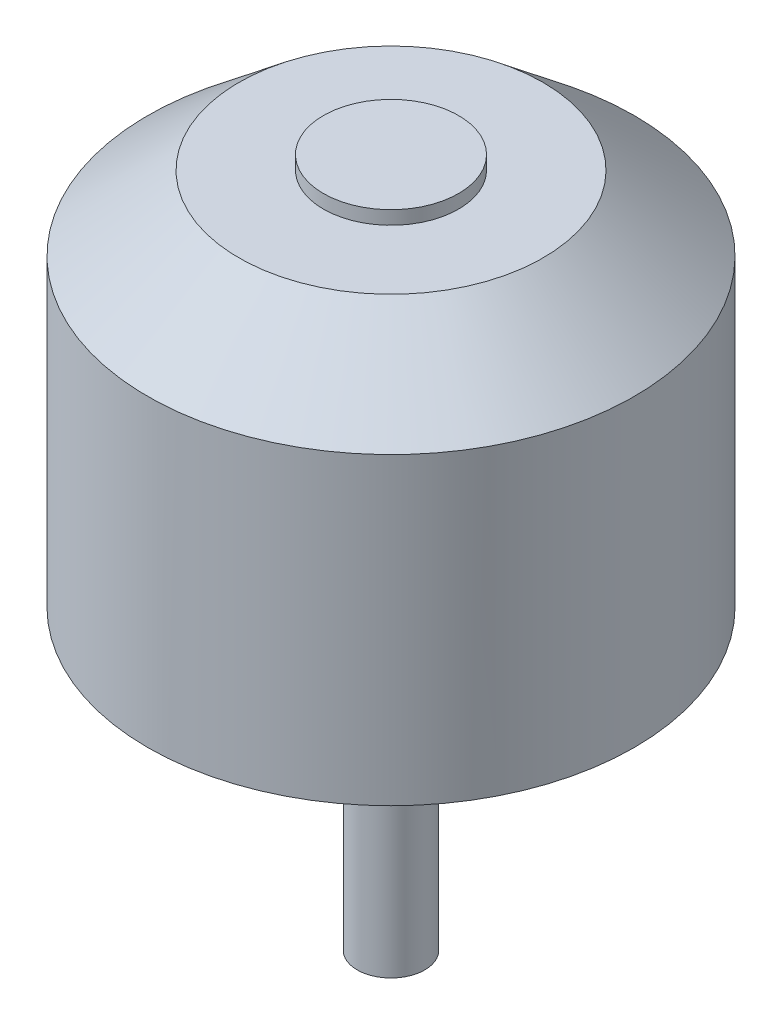
ISO-10303-21;
HEADER;
FILE_DESCRIPTION(('STEP AP214'),'2;1');
FILE_NAME('part.step','',(''),(''),'','','');
FILE_SCHEMA(('AUTOMOTIVE_DESIGN { 1 0 10303 214 1 1 1 1 }'));
ENDSEC;
DATA;
#1=APPLICATION_CONTEXT('core data for automotive mechanical design processes');
#2=APPLICATION_PROTOCOL_DEFINITION('international standard','automotive_design',2000,#1);
#3=PRODUCT_CONTEXT('',#1,'mechanical');
#4=PRODUCT('Part','Part','',(#3));
#5=PRODUCT_RELATED_PRODUCT_CATEGORY('part','',(#4));
#6=PRODUCT_DEFINITION_FORMATION('','',#4);
#7=PRODUCT_DEFINITION_CONTEXT('part definition',#1,'design');
#8=PRODUCT_DEFINITION('design','',#6,#7);
#9=PRODUCT_DEFINITION_SHAPE('','',#8);
#10=(LENGTH_UNIT() NAMED_UNIT(*) SI_UNIT(.MILLI.,.METRE.));
#11=(NAMED_UNIT(*) PLANE_ANGLE_UNIT() SI_UNIT($,.RADIAN.));
#12=(NAMED_UNIT(*) SI_UNIT($,.STERADIAN.) SOLID_ANGLE_UNIT());
#13=UNCERTAINTY_MEASURE_WITH_UNIT(LENGTH_MEASURE(1.E-05),#10,'distance_accuracy_value','');
#14=(GEOMETRIC_REPRESENTATION_CONTEXT(3) GLOBAL_UNCERTAINTY_ASSIGNED_CONTEXT((#13)) GLOBAL_UNIT_ASSIGNED_CONTEXT((#10,
#11,#12)) REPRESENTATION_CONTEXT('',''));
#15=CARTESIAN_POINT('',(0.,0.,0.));
#16=DIRECTION('',(0.,0.,1.));
#17=DIRECTION('',(1.,0.,0.));
#18=AXIS2_PLACEMENT_3D('',#15,#16,#17);
#19=CARTESIAN_POINT('',(0.,29.,0.));
#20=DIRECTION('',(0.,-1.,0.));
#21=DIRECTION('',(0.,0.,-1.));
#22=AXIS2_PLACEMENT_3D('',#19,#20,#21);
#23=CYLINDRICAL_SURFACE('',#22,18.);
#24=CARTESIAN_POINT('',(0.,0.,0.));
#25=DIRECTION('',(0.,1.,0.));
#26=DIRECTION('',(0.,0.,1.));
#27=AXIS2_PLACEMENT_3D('',#24,#25,#26);
#28=CIRCLE('',#27,18.);
#29=CARTESIAN_POINT('',(0.,0.,18.));
#30=VERTEX_POINT('',#29);
#31=EDGE_CURVE('E43',#30,#30,#28,.T.);
#32=ORIENTED_EDGE('',*,*,#31,.T.);
#33=EDGE_LOOP('',(#32));
#34=FACE_BOUND('',#33,.T.);
#35=CARTESIAN_POINT('',(0.,22.5,0.));
#36=DIRECTION('',(0.,-1.,0.));
#37=DIRECTION('',(0.,0.,-1.));
#38=AXIS2_PLACEMENT_3D('',#35,#36,#37);
#39=CIRCLE('',#38,18.);
#40=CARTESIAN_POINT('',(0.,22.5,-18.));
#41=VERTEX_POINT('',#40);
#42=EDGE_CURVE('E67',#41,#41,#39,.T.);
#43=ORIENTED_EDGE('',*,*,#42,.T.);
#44=EDGE_LOOP('',(#43));
#45=FACE_BOUND('',#44,.T.);
#46=ADVANCED_FACE('F36',(#34,#45),#23,.T.);
#47=CARTESIAN_POINT('',(0.,0.,0.));
#48=DIRECTION('',(0.,1.,0.));
#49=DIRECTION('',(0.,0.,1.));
#50=AXIS2_PLACEMENT_3D('',#47,#48,#49);
#51=PLANE('',#50);
#52=CARTESIAN_POINT('',(0.,0.,0.));
#53=DIRECTION('',(0.,1.,0.));
#54=DIRECTION('',(0.,0.,1.));
#55=AXIS2_PLACEMENT_3D('',#52,#53,#54);
#56=CIRCLE('',#55,2.5);
#57=CARTESIAN_POINT('',(0.,0.,2.5));
#58=VERTEX_POINT('',#57);
#59=EDGE_CURVE('E10',#58,#58,#56,.F.);
#60=ORIENTED_EDGE('',*,*,#59,.F.);
#61=EDGE_LOOP('',(#60));
#62=FACE_BOUND('',#61,.T.);
#63=ORIENTED_EDGE('',*,*,#31,.F.);
#64=EDGE_LOOP('',(#63));
#65=FACE_BOUND('',#64,.T.);
#66=ADVANCED_FACE('F91',(#62,#65),#51,.F.);
#67=CARTESIAN_POINT('',(0.,-22.,0.));
#68=DIRECTION('',(0.,1.,0.));
#69=DIRECTION('',(0.,0.,1.));
#70=AXIS2_PLACEMENT_3D('',#67,#68,#69);
#71=CYLINDRICAL_SURFACE('',#70,2.5);
#72=CARTESIAN_POINT('',(0.,-22.,0.));
#73=DIRECTION('',(0.,-1.,0.));
#74=DIRECTION('',(0.,0.,-1.));
#75=AXIS2_PLACEMENT_3D('',#72,#73,#74);
#76=CIRCLE('',#75,2.5);
#77=CARTESIAN_POINT('',(0.,-22.,-2.5));
#78=VERTEX_POINT('',#77);
#79=EDGE_CURVE('E48',#78,#78,#76,.T.);
#80=ORIENTED_EDGE('',*,*,#79,.F.);
#81=EDGE_LOOP('',(#80));
#82=FACE_BOUND('',#81,.T.);
#83=ORIENTED_EDGE('',*,*,#59,.T.);
#84=EDGE_LOOP('',(#83));
#85=FACE_BOUND('',#84,.T.);
#86=ADVANCED_FACE('F86',(#82,#85),#71,.T.);
#87=CARTESIAN_POINT('',(0.,-22.,0.));
#88=DIRECTION('',(0.,-1.,0.));
#89=DIRECTION('',(0.,0.,-1.));
#90=AXIS2_PLACEMENT_3D('',#87,#88,#89);
#91=PLANE('',#90);
#92=ORIENTED_EDGE('',*,*,#79,.T.);
#93=EDGE_LOOP('',(#92));
#94=FACE_BOUND('',#93,.T.);
#95=ADVANCED_FACE('F76',(#94),#91,.T.);
#96=CARTESIAN_POINT('',(0.,22.5,0.));
#97=DIRECTION('',(0.,-1.,0.));
#98=DIRECTION('',(0.,0.,-1.));
#99=AXIS2_PLACEMENT_3D('',#96,#97,#98);
#100=CONICAL_SURFACE('',#99,18.,0.887087015160525);
#101=CARTESIAN_POINT('',(0.,28.,0.));
#102=DIRECTION('',(0.,-1.,0.));
#103=DIRECTION('',(0.,0.,-1.));
#104=AXIS2_PLACEMENT_3D('',#101,#102,#103);
#105=CIRCLE('',#104,11.25);
#106=CARTESIAN_POINT('',(0.,28.,-11.25));
#107=VERTEX_POINT('',#106);
#108=EDGE_CURVE('E60',#107,#107,#105,.T.);
#109=ORIENTED_EDGE('',*,*,#108,.T.);
#110=EDGE_LOOP('',(#109));
#111=FACE_BOUND('',#110,.T.);
#112=ORIENTED_EDGE('',*,*,#42,.F.);
#113=EDGE_LOOP('',(#112));
#114=FACE_BOUND('',#113,.T.);
#115=ADVANCED_FACE('F73',(#111,#114),#100,.T.);
#116=CARTESIAN_POINT('',(0.,29.,0.));
#117=DIRECTION('',(0.,1.,0.));
#118=DIRECTION('',(0.,0.,1.));
#119=AXIS2_PLACEMENT_3D('',#116,#117,#118);
#120=PLANE('',#119);
#121=CARTESIAN_POINT('',(0.,29.,0.));
#122=DIRECTION('',(0.,1.,0.));
#123=DIRECTION('',(0.,0.,1.));
#124=AXIS2_PLACEMENT_3D('',#121,#122,#123);
#125=CIRCLE('',#124,5.);
#126=CARTESIAN_POINT('',(0.,29.,5.));
#127=VERTEX_POINT('',#126);
#128=EDGE_CURVE('E56',#127,#127,#125,.T.);
#129=ORIENTED_EDGE('',*,*,#128,.T.);
#130=EDGE_LOOP('',(#129));
#131=FACE_BOUND('',#130,.T.);
#132=ADVANCED_FACE('F75',(#131),#120,.T.);
#133=CARTESIAN_POINT('',(0.,28.,0.));
#134=DIRECTION('',(0.,1.,0.));
#135=DIRECTION('',(0.,0.,1.));
#136=AXIS2_PLACEMENT_3D('',#133,#134,#135);
#137=CYLINDRICAL_SURFACE('',#136,5.);
#138=CARTESIAN_POINT('',(0.,28.,0.));
#139=DIRECTION('',(0.,1.,0.));
#140=DIRECTION('',(0.,0.,1.));
#141=AXIS2_PLACEMENT_3D('',#138,#139,#140);
#142=CIRCLE('',#141,5.);
#143=CARTESIAN_POINT('',(0.,28.,5.));
#144=VERTEX_POINT('',#143);
#145=EDGE_CURVE('E53',#144,#144,#142,.T.);
#146=ORIENTED_EDGE('',*,*,#145,.T.);
#147=EDGE_LOOP('',(#146));
#148=FACE_BOUND('',#147,.T.);
#149=ORIENTED_EDGE('',*,*,#128,.F.);
#150=EDGE_LOOP('',(#149));
#151=FACE_BOUND('',#150,.T.);
#152=ADVANCED_FACE('F83',(#148,#151),#137,.T.);
#153=CARTESIAN_POINT('',(0.,28.,0.));
#154=DIRECTION('',(0.,1.,0.));
#155=DIRECTION('',(0.,0.,1.));
#156=AXIS2_PLACEMENT_3D('',#153,#154,#155);
#157=PLANE('',#156);
#158=ORIENTED_EDGE('',*,*,#145,.F.);
#159=EDGE_LOOP('',(#158));
#160=FACE_BOUND('',#159,.T.);
#161=ORIENTED_EDGE('',*,*,#108,.F.);
#162=EDGE_LOOP('',(#161));
#163=FACE_BOUND('',#162,.T.);
#164=ADVANCED_FACE('F103',(#160,#163),#157,.T.);
#165=CLOSED_SHELL('',(#46,#66,#86,#95,#115,#132,#152,#164));
#166=MANIFOLD_SOLID_BREP('B2',#165);
#167=ADVANCED_BREP_SHAPE_REPRESENTATION('',(#18,#166),#14);
#168=SHAPE_DEFINITION_REPRESENTATION(#9,#167);
ENDSEC;
END-ISO-10303-21;
